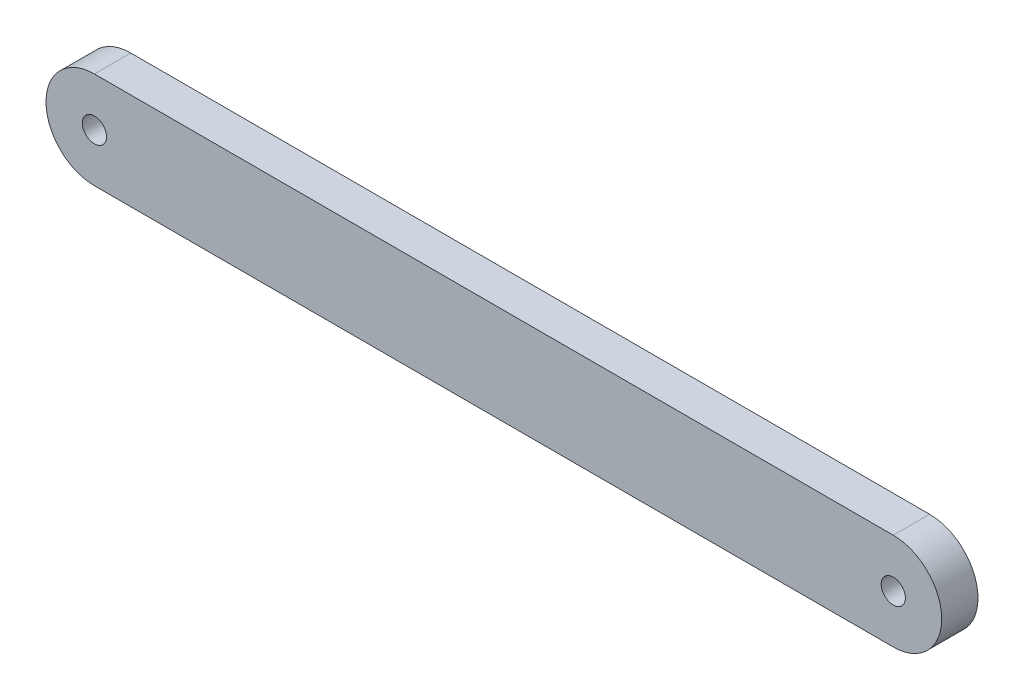
ISO-10303-21;
HEADER;
FILE_DESCRIPTION(('STEP AP214'),'2;1');
FILE_NAME('part.step','',(''),(''),'','','');
FILE_SCHEMA(('AUTOMOTIVE_DESIGN { 1 0 10303 214 1 1 1 1 }'));
ENDSEC;
DATA;
#1=APPLICATION_CONTEXT('core data for automotive mechanical design processes');
#2=APPLICATION_PROTOCOL_DEFINITION('international standard','automotive_design',2000,#1);
#3=PRODUCT_CONTEXT('',#1,'mechanical');
#4=PRODUCT('Part','Part','',(#3));
#5=PRODUCT_RELATED_PRODUCT_CATEGORY('part','',(#4));
#6=PRODUCT_DEFINITION_FORMATION('','',#4);
#7=PRODUCT_DEFINITION_CONTEXT('part definition',#1,'design');
#8=PRODUCT_DEFINITION('design','',#6,#7);
#9=PRODUCT_DEFINITION_SHAPE('','',#8);
#10=(LENGTH_UNIT() NAMED_UNIT(*) SI_UNIT(.MILLI.,.METRE.));
#11=(NAMED_UNIT(*) PLANE_ANGLE_UNIT() SI_UNIT($,.RADIAN.));
#12=(NAMED_UNIT(*) SI_UNIT($,.STERADIAN.) SOLID_ANGLE_UNIT());
#13=UNCERTAINTY_MEASURE_WITH_UNIT(LENGTH_MEASURE(1.E-05),#10,'distance_accuracy_value','');
#14=(GEOMETRIC_REPRESENTATION_CONTEXT(3) GLOBAL_UNCERTAINTY_ASSIGNED_CONTEXT((#13)) GLOBAL_UNIT_ASSIGNED_CONTEXT((#10,
#11,#12)) REPRESENTATION_CONTEXT('',''));
#15=CARTESIAN_POINT('',(0.,0.,0.));
#16=DIRECTION('',(0.,0.,1.));
#17=DIRECTION('',(1.,0.,0.));
#18=AXIS2_PLACEMENT_3D('',#15,#16,#17);
#19=CARTESIAN_POINT('',(4.,4.,3.));
#20=DIRECTION('',(0.,0.,-1.));
#21=DIRECTION('',(-1.,0.,0.));
#22=AXIS2_PLACEMENT_3D('',#19,#20,#21);
#23=PLANE('',#22);
#24=CARTESIAN_POINT('',(4.,4.,3.));
#25=DIRECTION('',(0.,0.,1.));
#26=DIRECTION('',(-1.,0.,0.));
#27=AXIS2_PLACEMENT_3D('',#24,#25,#26);
#28=CIRCLE('',#27,4.);
#29=CARTESIAN_POINT('',(4.,8.,3.));
#30=VERTEX_POINT('',#29);
#31=CARTESIAN_POINT('',(4.,0.,3.));
#32=VERTEX_POINT('',#31);
#33=EDGE_CURVE('E89',#30,#32,#28,.T.);
#34=ORIENTED_EDGE('',*,*,#33,.T.);
#35=DIRECTION('',(1.,0.,0.));
#36=VECTOR('',#35,1.);
#37=CARTESIAN_POINT('',(4.,0.,3.));
#38=LINE('',#37,#36);
#39=CARTESIAN_POINT('',(70.,0.,3.));
#40=VERTEX_POINT('',#39);
#41=EDGE_CURVE('E84',#32,#40,#38,.T.);
#42=ORIENTED_EDGE('',*,*,#41,.T.);
#43=CARTESIAN_POINT('',(70.,4.,3.));
#44=DIRECTION('',(0.,0.,1.));
#45=DIRECTION('',(-1.,0.,0.));
#46=AXIS2_PLACEMENT_3D('',#43,#44,#45);
#47=CIRCLE('',#46,4.);
#48=CARTESIAN_POINT('',(70.,8.,3.));
#49=VERTEX_POINT('',#48);
#50=EDGE_CURVE('E87',#40,#49,#47,.T.);
#51=ORIENTED_EDGE('',*,*,#50,.T.);
#52=DIRECTION('',(-1.,0.,0.));
#53=VECTOR('',#52,1.);
#54=CARTESIAN_POINT('',(70.,8.,3.));
#55=LINE('',#54,#53);
#56=EDGE_CURVE('E54',#49,#30,#55,.T.);
#57=ORIENTED_EDGE('',*,*,#56,.T.);
#58=EDGE_LOOP('',(#34,#42,#51,#57));
#59=FACE_BOUND('',#58,.T.);
#60=CARTESIAN_POINT('',(70.,4.,3.));
#61=DIRECTION('',(0.,0.,1.));
#62=DIRECTION('',(1.,0.,0.));
#63=AXIS2_PLACEMENT_3D('',#60,#61,#62);
#64=CIRCLE('',#63,0.999999999999998);
#65=CARTESIAN_POINT('',(71.,4.,3.));
#66=VERTEX_POINT('',#65);
#67=EDGE_CURVE('E104',#66,#66,#64,.T.);
#68=ORIENTED_EDGE('',*,*,#67,.F.);
#69=EDGE_LOOP('',(#68));
#70=FACE_BOUND('',#69,.T.);
#71=CARTESIAN_POINT('',(4.,4.,3.));
#72=DIRECTION('',(0.,0.,1.));
#73=DIRECTION('',(1.,0.,0.));
#74=AXIS2_PLACEMENT_3D('',#71,#72,#73);
#75=CIRCLE('',#74,1.);
#76=CARTESIAN_POINT('',(5.,4.,3.));
#77=VERTEX_POINT('',#76);
#78=EDGE_CURVE('E119',#77,#77,#75,.T.);
#79=ORIENTED_EDGE('',*,*,#78,.F.);
#80=EDGE_LOOP('',(#79));
#81=FACE_BOUND('',#80,.T.);
#82=ADVANCED_FACE('F37',(#59,#70,#81),#23,.F.);
#83=CARTESIAN_POINT('',(4.,4.,0.));
#84=DIRECTION('',(0.,0.,-1.));
#85=DIRECTION('',(-1.,0.,0.));
#86=AXIS2_PLACEMENT_3D('',#83,#84,#85);
#87=PLANE('',#86);
#88=CARTESIAN_POINT('',(70.,4.,0.));
#89=DIRECTION('',(0.,0.,1.));
#90=DIRECTION('',(1.,0.,0.));
#91=AXIS2_PLACEMENT_3D('',#88,#89,#90);
#92=CIRCLE('',#91,0.999999999999998);
#93=CARTESIAN_POINT('',(71.,4.,0.));
#94=VERTEX_POINT('',#93);
#95=EDGE_CURVE('E116',#94,#94,#92,.T.);
#96=ORIENTED_EDGE('',*,*,#95,.T.);
#97=EDGE_LOOP('',(#96));
#98=FACE_BOUND('',#97,.T.);
#99=CARTESIAN_POINT('',(4.,4.,0.));
#100=DIRECTION('',(0.,0.,1.));
#101=DIRECTION('',(-1.,0.,0.));
#102=AXIS2_PLACEMENT_3D('',#99,#100,#101);
#103=CIRCLE('',#102,4.);
#104=CARTESIAN_POINT('',(4.,8.,0.));
#105=VERTEX_POINT('',#104);
#106=CARTESIAN_POINT('',(4.,0.,0.));
#107=VERTEX_POINT('',#106);
#108=EDGE_CURVE('E101',#105,#107,#103,.T.);
#109=ORIENTED_EDGE('',*,*,#108,.F.);
#110=DIRECTION('',(-1.,0.,0.));
#111=VECTOR('',#110,1.);
#112=CARTESIAN_POINT('',(70.,8.,0.));
#113=LINE('',#112,#111);
#114=CARTESIAN_POINT('',(70.,8.,0.));
#115=VERTEX_POINT('',#114);
#116=EDGE_CURVE('E77',#115,#105,#113,.T.);
#117=ORIENTED_EDGE('',*,*,#116,.F.);
#118=CARTESIAN_POINT('',(70.,4.,0.));
#119=DIRECTION('',(0.,0.,1.));
#120=DIRECTION('',(-1.,0.,0.));
#121=AXIS2_PLACEMENT_3D('',#118,#119,#120);
#122=CIRCLE('',#121,4.);
#123=CARTESIAN_POINT('',(70.,0.,0.));
#124=VERTEX_POINT('',#123);
#125=EDGE_CURVE('E71',#124,#115,#122,.T.);
#126=ORIENTED_EDGE('',*,*,#125,.F.);
#127=DIRECTION('',(1.,0.,0.));
#128=VECTOR('',#127,1.);
#129=CARTESIAN_POINT('',(4.,0.,0.));
#130=LINE('',#129,#128);
#131=EDGE_CURVE('E93',#107,#124,#130,.T.);
#132=ORIENTED_EDGE('',*,*,#131,.F.);
#133=EDGE_LOOP('',(#109,#117,#126,#132));
#134=FACE_BOUND('',#133,.T.);
#135=CARTESIAN_POINT('',(4.,4.,0.));
#136=DIRECTION('',(0.,0.,1.));
#137=DIRECTION('',(1.,0.,0.));
#138=AXIS2_PLACEMENT_3D('',#135,#136,#137);
#139=CIRCLE('',#138,1.);
#140=CARTESIAN_POINT('',(5.,4.,0.));
#141=VERTEX_POINT('',#140);
#142=EDGE_CURVE('E122',#141,#141,#139,.T.);
#143=ORIENTED_EDGE('',*,*,#142,.T.);
#144=EDGE_LOOP('',(#143));
#145=FACE_BOUND('',#144,.T.);
#146=ADVANCED_FACE('F112',(#98,#134,#145),#87,.T.);
#147=CARTESIAN_POINT('',(4.,4.,3.));
#148=DIRECTION('',(0.,0.,-1.));
#149=DIRECTION('',(-1.,0.,0.));
#150=AXIS2_PLACEMENT_3D('',#147,#148,#149);
#151=CYLINDRICAL_SURFACE('',#150,4.);
#152=ORIENTED_EDGE('',*,*,#108,.T.);
#153=DIRECTION('',(0.,0.,-1.));
#154=VECTOR('',#153,1.);
#155=CARTESIAN_POINT('',(4.,0.,3.));
#156=LINE('',#155,#154);
#157=EDGE_CURVE('E11',#32,#107,#156,.T.);
#158=ORIENTED_EDGE('',*,*,#157,.F.);
#159=ORIENTED_EDGE('',*,*,#33,.F.);
#160=DIRECTION('',(0.,0.,-1.));
#161=VECTOR('',#160,1.);
#162=CARTESIAN_POINT('',(4.,8.,3.));
#163=LINE('',#162,#161);
#164=EDGE_CURVE('E97',#30,#105,#163,.T.);
#165=ORIENTED_EDGE('',*,*,#164,.T.);
#166=EDGE_LOOP('',(#152,#158,#159,#165));
#167=FACE_BOUND('',#166,.T.);
#168=ADVANCED_FACE('F39',(#167),#151,.T.);
#169=CARTESIAN_POINT('',(4.,0.,3.));
#170=DIRECTION('',(0.,1.,0.));
#171=DIRECTION('',(0.,0.,1.));
#172=AXIS2_PLACEMENT_3D('',#169,#170,#171);
#173=PLANE('',#172);
#174=ORIENTED_EDGE('',*,*,#131,.T.);
#175=DIRECTION('',(0.,0.,-1.));
#176=VECTOR('',#175,1.);
#177=CARTESIAN_POINT('',(70.,0.,3.));
#178=LINE('',#177,#176);
#179=EDGE_CURVE('E46',#40,#124,#178,.T.);
#180=ORIENTED_EDGE('',*,*,#179,.F.);
#181=ORIENTED_EDGE('',*,*,#41,.F.);
#182=ORIENTED_EDGE('',*,*,#157,.T.);
#183=EDGE_LOOP('',(#174,#180,#181,#182));
#184=FACE_BOUND('',#183,.T.);
#185=ADVANCED_FACE('F92',(#184),#173,.F.);
#186=CARTESIAN_POINT('',(70.,4.,3.));
#187=DIRECTION('',(0.,0.,-1.));
#188=DIRECTION('',(-1.,0.,0.));
#189=AXIS2_PLACEMENT_3D('',#186,#187,#188);
#190=CYLINDRICAL_SURFACE('',#189,4.);
#191=ORIENTED_EDGE('',*,*,#125,.T.);
#192=DIRECTION('',(0.,0.,-1.));
#193=VECTOR('',#192,1.);
#194=CARTESIAN_POINT('',(70.,8.,3.));
#195=LINE('',#194,#193);
#196=EDGE_CURVE('E94',#49,#115,#195,.T.);
#197=ORIENTED_EDGE('',*,*,#196,.F.);
#198=ORIENTED_EDGE('',*,*,#50,.F.);
#199=ORIENTED_EDGE('',*,*,#179,.T.);
#200=EDGE_LOOP('',(#191,#197,#198,#199));
#201=FACE_BOUND('',#200,.T.);
#202=ADVANCED_FACE('F95',(#201),#190,.T.);
#203=CARTESIAN_POINT('',(70.,8.,3.));
#204=DIRECTION('',(0.,-1.,0.));
#205=DIRECTION('',(0.,0.,-1.));
#206=AXIS2_PLACEMENT_3D('',#203,#204,#205);
#207=PLANE('',#206);
#208=ORIENTED_EDGE('',*,*,#116,.T.);
#209=ORIENTED_EDGE('',*,*,#164,.F.);
#210=ORIENTED_EDGE('',*,*,#56,.F.);
#211=ORIENTED_EDGE('',*,*,#196,.T.);
#212=EDGE_LOOP('',(#208,#209,#210,#211));
#213=FACE_BOUND('',#212,.T.);
#214=ADVANCED_FACE('F109',(#213),#207,.F.);
#215=CARTESIAN_POINT('',(70.,4.,3.));
#216=DIRECTION('',(0.,0.,-1.));
#217=DIRECTION('',(-1.,0.,0.));
#218=AXIS2_PLACEMENT_3D('',#215,#216,#217);
#219=CYLINDRICAL_SURFACE('',#218,0.999999999999998);
#220=ORIENTED_EDGE('',*,*,#67,.T.);
#221=EDGE_LOOP('',(#220));
#222=FACE_BOUND('',#221,.T.);
#223=ORIENTED_EDGE('',*,*,#95,.F.);
#224=EDGE_LOOP('',(#223));
#225=FACE_BOUND('',#224,.T.);
#226=ADVANCED_FACE('F139',(#222,#225),#219,.F.);
#227=CARTESIAN_POINT('',(4.,4.,3.));
#228=DIRECTION('',(0.,0.,-1.));
#229=DIRECTION('',(-1.,0.,0.));
#230=AXIS2_PLACEMENT_3D('',#227,#228,#229);
#231=CYLINDRICAL_SURFACE('',#230,1.);
#232=ORIENTED_EDGE('',*,*,#78,.T.);
#233=EDGE_LOOP('',(#232));
#234=FACE_BOUND('',#233,.T.);
#235=ORIENTED_EDGE('',*,*,#142,.F.);
#236=EDGE_LOOP('',(#235));
#237=FACE_BOUND('',#236,.T.);
#238=ADVANCED_FACE('F128',(#234,#237),#231,.F.);
#239=CLOSED_SHELL('',(#82,#146,#168,#185,#202,#214,#226,#238));
#240=MANIFOLD_SOLID_BREP('B2',#239);
#241=ADVANCED_BREP_SHAPE_REPRESENTATION('',(#18,#240),#14);
#242=SHAPE_DEFINITION_REPRESENTATION(#9,#241);
ENDSEC;
END-ISO-10303-21;
